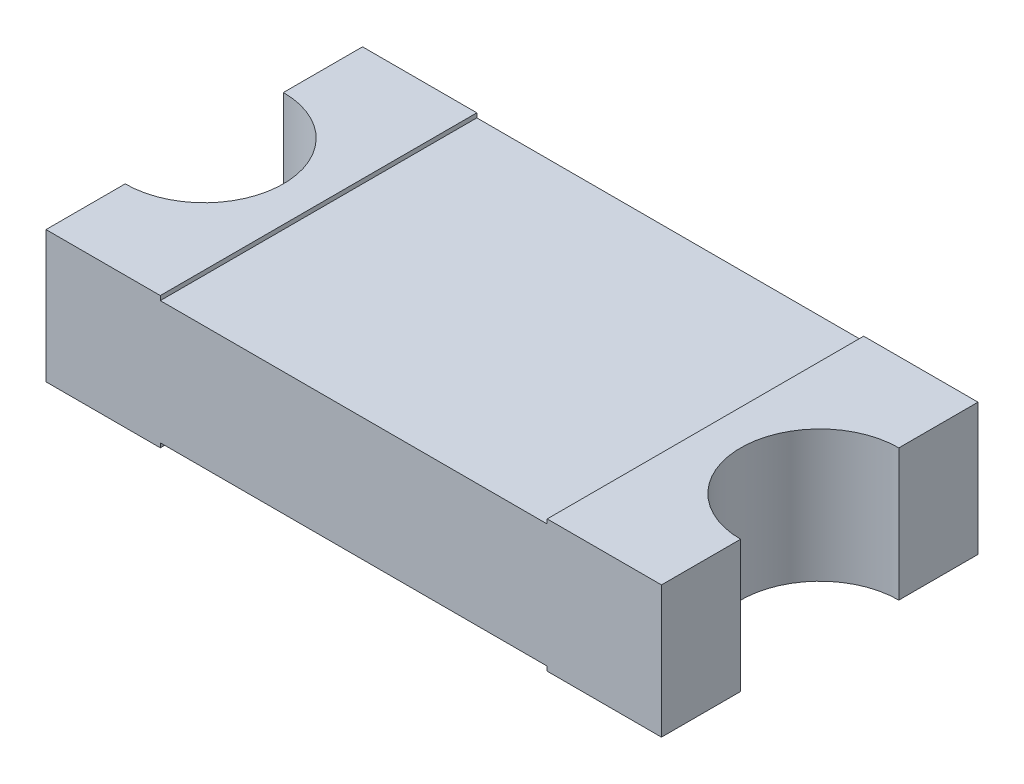
ISO-10303-21;
HEADER;
FILE_DESCRIPTION(('STEP AP214'),'2;1');
FILE_NAME('part.step','',(''),(''),'','','');
FILE_SCHEMA(('AUTOMOTIVE_DESIGN { 1 0 10303 214 1 1 1 1 }'));
ENDSEC;
DATA;
#1=APPLICATION_CONTEXT('core data for automotive mechanical design processes');
#2=APPLICATION_PROTOCOL_DEFINITION('international standard','automotive_design',2000,#1);
#3=PRODUCT_CONTEXT('',#1,'mechanical');
#4=PRODUCT('Part','Part','',(#3));
#5=PRODUCT_RELATED_PRODUCT_CATEGORY('part','',(#4));
#6=PRODUCT_DEFINITION_FORMATION('','',#4);
#7=PRODUCT_DEFINITION_CONTEXT('part definition',#1,'design');
#8=PRODUCT_DEFINITION('design','',#6,#7);
#9=PRODUCT_DEFINITION_SHAPE('','',#8);
#10=(LENGTH_UNIT() NAMED_UNIT(*) SI_UNIT(.MILLI.,.METRE.));
#11=(NAMED_UNIT(*) PLANE_ANGLE_UNIT() SI_UNIT($,.RADIAN.));
#12=(NAMED_UNIT(*) SI_UNIT($,.STERADIAN.) SOLID_ANGLE_UNIT());
#13=UNCERTAINTY_MEASURE_WITH_UNIT(LENGTH_MEASURE(1.E-05),#10,'distance_accuracy_value','');
#14=(GEOMETRIC_REPRESENTATION_CONTEXT(3) GLOBAL_UNCERTAINTY_ASSIGNED_CONTEXT((#13)) GLOBAL_UNIT_ASSIGNED_CONTEXT((#10,
#11,#12)) REPRESENTATION_CONTEXT('',''));
#15=CARTESIAN_POINT('',(0.,0.,0.));
#16=DIRECTION('',(0.,0.,1.));
#17=DIRECTION('',(1.,0.,0.));
#18=AXIS2_PLACEMENT_3D('',#15,#16,#17);
#19=CARTESIAN_POINT('',(-1.75,0.75,-0.9));
#20=DIRECTION('',(0.,0.,1.));
#21=DIRECTION('',(1.,0.,0.));
#22=AXIS2_PLACEMENT_3D('',#19,#20,#21);
#23=PLANE('',#22);
#24=DIRECTION('',(0.,-1.,0.));
#25=VECTOR('',#24,1.);
#26=CARTESIAN_POINT('',(1.1,0.025,-0.9));
#27=LINE('',#26,#25);
#28=CARTESIAN_POINT('',(1.1,0.025,-0.9));
#29=VERTEX_POINT('',#28);
#30=CARTESIAN_POINT('',(1.1,0.,-0.9));
#31=VERTEX_POINT('',#30);
#32=EDGE_CURVE('E174',#29,#31,#27,.T.);
#33=ORIENTED_EDGE('',*,*,#32,.F.);
#34=DIRECTION('',(-1.,0.,0.));
#35=VECTOR('',#34,1.);
#36=CARTESIAN_POINT('',(-1.1,0.025,-0.9));
#37=LINE('',#36,#35);
#38=CARTESIAN_POINT('',(-1.1,0.025,-0.9));
#39=VERTEX_POINT('',#38);
#40=EDGE_CURVE('E155',#29,#39,#37,.T.);
#41=ORIENTED_EDGE('',*,*,#40,.T.);
#42=DIRECTION('',(0.,-1.,0.));
#43=VECTOR('',#42,1.);
#44=CARTESIAN_POINT('',(-1.1,0.025,-0.9));
#45=LINE('',#44,#43);
#46=CARTESIAN_POINT('',(-1.1,0.,-0.9));
#47=VERTEX_POINT('',#46);
#48=EDGE_CURVE('E177',#39,#47,#45,.T.);
#49=ORIENTED_EDGE('',*,*,#48,.T.);
#50=DIRECTION('',(-1.,0.,0.));
#51=VECTOR('',#50,1.);
#52=CARTESIAN_POINT('',(-1.75,0.,-0.9));
#53=LINE('',#52,#51);
#54=CARTESIAN_POINT('',(-1.75,0.,-0.9));
#55=VERTEX_POINT('',#54);
#56=EDGE_CURVE('E199',#47,#55,#53,.T.);
#57=ORIENTED_EDGE('',*,*,#56,.T.);
#58=DIRECTION('',(0.,-1.,0.));
#59=VECTOR('',#58,1.);
#60=CARTESIAN_POINT('',(-1.75,0.75,-0.9));
#61=LINE('',#60,#59);
#62=CARTESIAN_POINT('',(-1.75,0.75,-0.9));
#63=VERTEX_POINT('',#62);
#64=EDGE_CURVE('E11',#63,#55,#61,.T.);
#65=ORIENTED_EDGE('',*,*,#64,.F.);
#66=DIRECTION('',(-1.,0.,0.));
#67=VECTOR('',#66,1.);
#68=CARTESIAN_POINT('',(-1.75,0.75,-0.9));
#69=LINE('',#68,#67);
#70=CARTESIAN_POINT('',(-1.1,0.75,-0.9));
#71=VERTEX_POINT('',#70);
#72=EDGE_CURVE('E210',#71,#63,#69,.T.);
#73=ORIENTED_EDGE('',*,*,#72,.F.);
#74=DIRECTION('',(0.,1.,0.));
#75=VECTOR('',#74,1.);
#76=CARTESIAN_POINT('',(-1.1,0.725,-0.9));
#77=LINE('',#76,#75);
#78=CARTESIAN_POINT('',(-1.1,0.725,-0.9));
#79=VERTEX_POINT('',#78);
#80=EDGE_CURVE('E55',#79,#71,#77,.T.);
#81=ORIENTED_EDGE('',*,*,#80,.F.);
#82=DIRECTION('',(-1.,0.,0.));
#83=VECTOR('',#82,1.);
#84=CARTESIAN_POINT('',(-1.1,0.725,-0.9));
#85=LINE('',#84,#83);
#86=CARTESIAN_POINT('',(1.1,0.725,-0.9));
#87=VERTEX_POINT('',#86);
#88=EDGE_CURVE('E184',#87,#79,#85,.T.);
#89=ORIENTED_EDGE('',*,*,#88,.F.);
#90=DIRECTION('',(0.,1.,0.));
#91=VECTOR('',#90,1.);
#92=CARTESIAN_POINT('',(1.1,0.725,-0.9));
#93=LINE('',#92,#91);
#94=CARTESIAN_POINT('',(1.1,0.75,-0.9));
#95=VERTEX_POINT('',#94);
#96=EDGE_CURVE('E194',#87,#95,#93,.T.);
#97=ORIENTED_EDGE('',*,*,#96,.T.);
#98=CARTESIAN_POINT('',(1.75,0.75,-0.9));
#99=VERTEX_POINT('',#98);
#100=EDGE_CURVE('E206',#99,#95,#69,.T.);
#101=ORIENTED_EDGE('',*,*,#100,.F.);
#102=DIRECTION('',(0.,-1.,0.));
#103=VECTOR('',#102,1.);
#104=CARTESIAN_POINT('',(1.75,0.75,-0.9));
#105=LINE('',#104,#103);
#106=CARTESIAN_POINT('',(1.75,0.,-0.9));
#107=VERTEX_POINT('',#106);
#108=EDGE_CURVE('E226',#99,#107,#105,.T.);
#109=ORIENTED_EDGE('',*,*,#108,.T.);
#110=EDGE_CURVE('E227',#107,#31,#53,.T.);
#111=ORIENTED_EDGE('',*,*,#110,.T.);
#112=EDGE_LOOP('',(#33,#41,#49,#57,#65,#73,#81,#89,#97,#101,#109,#111));
#113=FACE_BOUND('',#112,.T.);
#114=ADVANCED_FACE('F33',(#113),#23,.F.);
#115=CARTESIAN_POINT('',(-1.75,0.75,0.9));
#116=DIRECTION('',(0.,0.,-1.));
#117=DIRECTION('',(-1.,0.,0.));
#118=AXIS2_PLACEMENT_3D('',#115,#116,#117);
#119=PLANE('',#118);
#120=DIRECTION('',(0.,-1.,0.));
#121=VECTOR('',#120,1.);
#122=CARTESIAN_POINT('',(1.1,0.025,0.9));
#123=LINE('',#122,#121);
#124=CARTESIAN_POINT('',(1.1,0.025,0.9));
#125=VERTEX_POINT('',#124);
#126=CARTESIAN_POINT('',(1.1,0.,0.9));
#127=VERTEX_POINT('',#126);
#128=EDGE_CURVE('E145',#125,#127,#123,.T.);
#129=ORIENTED_EDGE('',*,*,#128,.T.);
#130=DIRECTION('',(1.,0.,0.));
#131=VECTOR('',#130,1.);
#132=CARTESIAN_POINT('',(-1.75,0.,0.9));
#133=LINE('',#132,#131);
#134=CARTESIAN_POINT('',(1.75,0.,0.9));
#135=VERTEX_POINT('',#134);
#136=EDGE_CURVE('E236',#127,#135,#133,.T.);
#137=ORIENTED_EDGE('',*,*,#136,.T.);
#138=DIRECTION('',(0.,-1.,0.));
#139=VECTOR('',#138,1.);
#140=CARTESIAN_POINT('',(1.75,0.75,0.9));
#141=LINE('',#140,#139);
#142=CARTESIAN_POINT('',(1.75,0.75,0.9));
#143=VERTEX_POINT('',#142);
#144=EDGE_CURVE('E253',#143,#135,#141,.T.);
#145=ORIENTED_EDGE('',*,*,#144,.F.);
#146=DIRECTION('',(1.,0.,0.));
#147=VECTOR('',#146,1.);
#148=CARTESIAN_POINT('',(-1.75,0.75,0.9));
#149=LINE('',#148,#147);
#150=CARTESIAN_POINT('',(1.1,0.75,0.9));
#151=VERTEX_POINT('',#150);
#152=EDGE_CURVE('E216',#151,#143,#149,.T.);
#153=ORIENTED_EDGE('',*,*,#152,.F.);
#154=DIRECTION('',(0.,1.,0.));
#155=VECTOR('',#154,1.);
#156=CARTESIAN_POINT('',(1.1,0.725,0.9));
#157=LINE('',#156,#155);
#158=CARTESIAN_POINT('',(1.1,0.725,0.9));
#159=VERTEX_POINT('',#158);
#160=EDGE_CURVE('E197',#159,#151,#157,.T.);
#161=ORIENTED_EDGE('',*,*,#160,.F.);
#162=DIRECTION('',(1.,0.,0.));
#163=VECTOR('',#162,1.);
#164=CARTESIAN_POINT('',(-1.1,0.725,0.9));
#165=LINE('',#164,#163);
#166=CARTESIAN_POINT('',(-1.1,0.725,0.9));
#167=VERTEX_POINT('',#166);
#168=EDGE_CURVE('E191',#167,#159,#165,.T.);
#169=ORIENTED_EDGE('',*,*,#168,.F.);
#170=DIRECTION('',(0.,1.,0.));
#171=VECTOR('',#170,1.);
#172=CARTESIAN_POINT('',(-1.1,0.725,0.9));
#173=LINE('',#172,#171);
#174=CARTESIAN_POINT('',(-1.1,0.75,0.9));
#175=VERTEX_POINT('',#174);
#176=EDGE_CURVE('E200',#167,#175,#173,.T.);
#177=ORIENTED_EDGE('',*,*,#176,.T.);
#178=CARTESIAN_POINT('',(-1.75,0.75,0.9));
#179=VERTEX_POINT('',#178);
#180=EDGE_CURVE('E217',#179,#175,#149,.T.);
#181=ORIENTED_EDGE('',*,*,#180,.F.);
#182=DIRECTION('',(0.,-1.,0.));
#183=VECTOR('',#182,1.);
#184=CARTESIAN_POINT('',(-1.75,0.75,0.9));
#185=LINE('',#184,#183);
#186=CARTESIAN_POINT('',(-1.75,0.,0.9));
#187=VERTEX_POINT('',#186);
#188=EDGE_CURVE('E256',#179,#187,#185,.T.);
#189=ORIENTED_EDGE('',*,*,#188,.T.);
#190=CARTESIAN_POINT('',(-1.1,0.,0.9));
#191=VERTEX_POINT('',#190);
#192=EDGE_CURVE('E237',#187,#191,#133,.T.);
#193=ORIENTED_EDGE('',*,*,#192,.T.);
#194=DIRECTION('',(0.,-1.,0.));
#195=VECTOR('',#194,1.);
#196=CARTESIAN_POINT('',(-1.1,0.025,0.9));
#197=LINE('',#196,#195);
#198=CARTESIAN_POINT('',(-1.1,0.025,0.9));
#199=VERTEX_POINT('',#198);
#200=EDGE_CURVE('E47',#199,#191,#197,.T.);
#201=ORIENTED_EDGE('',*,*,#200,.F.);
#202=DIRECTION('',(1.,0.,0.));
#203=VECTOR('',#202,1.);
#204=CARTESIAN_POINT('',(-1.1,0.025,0.9));
#205=LINE('',#204,#203);
#206=EDGE_CURVE('E161',#199,#125,#205,.T.);
#207=ORIENTED_EDGE('',*,*,#206,.T.);
#208=EDGE_LOOP('',(#129,#137,#145,#153,#161,#169,#177,#181,#189,#193,#201,#207));
#209=FACE_BOUND('',#208,.T.);
#210=ADVANCED_FACE('F165',(#209),#119,.F.);
#211=CARTESIAN_POINT('',(1.75,0.,0.));
#212=DIRECTION('',(0.,1.,0.));
#213=DIRECTION('',(0.,0.,1.));
#214=AXIS2_PLACEMENT_3D('',#211,#212,#213);
#215=PLANE('',#214);
#216=DIRECTION('',(0.,0.,-1.));
#217=VECTOR('',#216,1.);
#218=CARTESIAN_POINT('',(1.1,0.,-0.9));
#219=LINE('',#218,#217);
#220=EDGE_CURVE('E151',#127,#31,#219,.T.);
#221=ORIENTED_EDGE('',*,*,#220,.T.);
#222=ORIENTED_EDGE('',*,*,#110,.F.);
#223=DIRECTION('',(0.,0.,-1.));
#224=VECTOR('',#223,1.);
#225=CARTESIAN_POINT('',(1.75,0.,-0.45));
#226=LINE('',#225,#224);
#227=CARTESIAN_POINT('',(1.75,0.,-0.45));
#228=VERTEX_POINT('',#227);
#229=EDGE_CURVE('E243',#228,#107,#226,.T.);
#230=ORIENTED_EDGE('',*,*,#229,.F.);
#231=CARTESIAN_POINT('',(1.75,0.,0.));
#232=DIRECTION('',(0.,-1.,0.));
#233=DIRECTION('',(0.,0.,1.));
#234=AXIS2_PLACEMENT_3D('',#231,#232,#233);
#235=CIRCLE('',#234,0.45);
#236=CARTESIAN_POINT('',(1.75,0.,0.45));
#237=VERTEX_POINT('',#236);
#238=EDGE_CURVE('E241',#237,#228,#235,.T.);
#239=ORIENTED_EDGE('',*,*,#238,.F.);
#240=DIRECTION('',(0.,0.,-1.));
#241=VECTOR('',#240,1.);
#242=CARTESIAN_POINT('',(1.75,0.,0.9));
#243=LINE('',#242,#241);
#244=EDGE_CURVE('E239',#135,#237,#243,.T.);
#245=ORIENTED_EDGE('',*,*,#244,.F.);
#246=ORIENTED_EDGE('',*,*,#136,.F.);
#247=EDGE_LOOP('',(#221,#222,#230,#239,#245,#246));
#248=FACE_BOUND('',#247,.T.);
#249=ADVANCED_FACE('F291',(#248),#215,.F.);
#250=DIRECTION('',(0.,0.,1.));
#251=VECTOR('',#250,1.);
#252=CARTESIAN_POINT('',(-1.1,0.,-0.9));
#253=LINE('',#252,#251);
#254=EDGE_CURVE('E163',#47,#191,#253,.T.);
#255=ORIENTED_EDGE('',*,*,#254,.T.);
#256=ORIENTED_EDGE('',*,*,#192,.F.);
#257=DIRECTION('',(0.,0.,1.));
#258=VECTOR('',#257,1.);
#259=CARTESIAN_POINT('',(-1.75,0.,0.9));
#260=LINE('',#259,#258);
#261=CARTESIAN_POINT('',(-1.75,0.,0.45));
#262=VERTEX_POINT('',#261);
#263=EDGE_CURVE('E234',#262,#187,#260,.T.);
#264=ORIENTED_EDGE('',*,*,#263,.F.);
#265=CARTESIAN_POINT('',(-1.75,0.,0.));
#266=DIRECTION('',(0.,-1.,0.));
#267=DIRECTION('',(0.,0.,-1.));
#268=AXIS2_PLACEMENT_3D('',#265,#266,#267);
#269=CIRCLE('',#268,0.45);
#270=CARTESIAN_POINT('',(-1.75,0.,-0.45));
#271=VERTEX_POINT('',#270);
#272=EDGE_CURVE('E232',#271,#262,#269,.T.);
#273=ORIENTED_EDGE('',*,*,#272,.F.);
#274=DIRECTION('',(0.,0.,1.));
#275=VECTOR('',#274,1.);
#276=CARTESIAN_POINT('',(-1.75,0.,-0.45));
#277=LINE('',#276,#275);
#278=EDGE_CURVE('E230',#55,#271,#277,.T.);
#279=ORIENTED_EDGE('',*,*,#278,.F.);
#280=ORIENTED_EDGE('',*,*,#56,.F.);
#281=EDGE_LOOP('',(#255,#256,#264,#273,#279,#280));
#282=FACE_BOUND('',#281,.T.);
#283=ADVANCED_FACE('F273',(#282),#215,.F.);
#284=CARTESIAN_POINT('',(1.75,0.75,0.));
#285=DIRECTION('',(0.,1.,0.));
#286=DIRECTION('',(0.,0.,1.));
#287=AXIS2_PLACEMENT_3D('',#284,#285,#286);
#288=PLANE('',#287);
#289=DIRECTION('',(0.,0.,-1.));
#290=VECTOR('',#289,1.);
#291=CARTESIAN_POINT('',(1.1,0.75,-0.9));
#292=LINE('',#291,#290);
#293=EDGE_CURVE('E176',#151,#95,#292,.T.);
#294=ORIENTED_EDGE('',*,*,#293,.F.);
#295=ORIENTED_EDGE('',*,*,#152,.T.);
#296=DIRECTION('',(0.,0.,-1.));
#297=VECTOR('',#296,1.);
#298=CARTESIAN_POINT('',(1.75,0.75,0.9));
#299=LINE('',#298,#297);
#300=CARTESIAN_POINT('',(1.75,0.75,0.45));
#301=VERTEX_POINT('',#300);
#302=EDGE_CURVE('E220',#143,#301,#299,.T.);
#303=ORIENTED_EDGE('',*,*,#302,.T.);
#304=CARTESIAN_POINT('',(1.75,0.75,0.));
#305=DIRECTION('',(0.,-1.,0.));
#306=DIRECTION('',(0.,0.,1.));
#307=AXIS2_PLACEMENT_3D('',#304,#305,#306);
#308=CIRCLE('',#307,0.45);
#309=CARTESIAN_POINT('',(1.75,0.75,-0.45));
#310=VERTEX_POINT('',#309);
#311=EDGE_CURVE('E222',#301,#310,#308,.T.);
#312=ORIENTED_EDGE('',*,*,#311,.T.);
#313=DIRECTION('',(0.,0.,-1.));
#314=VECTOR('',#313,1.);
#315=CARTESIAN_POINT('',(1.75,0.75,-0.45));
#316=LINE('',#315,#314);
#317=EDGE_CURVE('E224',#310,#99,#316,.T.);
#318=ORIENTED_EDGE('',*,*,#317,.T.);
#319=ORIENTED_EDGE('',*,*,#100,.T.);
#320=EDGE_LOOP('',(#294,#295,#303,#312,#318,#319));
#321=FACE_BOUND('',#320,.T.);
#322=ADVANCED_FACE('F304',(#321),#288,.T.);
#323=CARTESIAN_POINT('',(-1.75,0.75,-0.45));
#324=DIRECTION('',(1.,0.,0.));
#325=DIRECTION('',(0.,0.,-1.));
#326=AXIS2_PLACEMENT_3D('',#323,#324,#325);
#327=PLANE('',#326);
#328=ORIENTED_EDGE('',*,*,#278,.T.);
#329=DIRECTION('',(0.,-1.,0.));
#330=VECTOR('',#329,1.);
#331=CARTESIAN_POINT('',(-1.75,0.75,-0.45));
#332=LINE('',#331,#330);
#333=CARTESIAN_POINT('',(-1.75,0.75,-0.45));
#334=VERTEX_POINT('',#333);
#335=EDGE_CURVE('E40',#334,#271,#332,.T.);
#336=ORIENTED_EDGE('',*,*,#335,.F.);
#337=DIRECTION('',(0.,0.,1.));
#338=VECTOR('',#337,1.);
#339=CARTESIAN_POINT('',(-1.75,0.75,-0.45));
#340=LINE('',#339,#338);
#341=EDGE_CURVE('E209',#63,#334,#340,.T.);
#342=ORIENTED_EDGE('',*,*,#341,.F.);
#343=ORIENTED_EDGE('',*,*,#64,.T.);
#344=EDGE_LOOP('',(#328,#336,#342,#343));
#345=FACE_BOUND('',#344,.T.);
#346=ADVANCED_FACE('F286',(#345),#327,.F.);
#347=CARTESIAN_POINT('',(-1.75,0.75,0.));
#348=DIRECTION('',(0.,-1.,0.));
#349=DIRECTION('',(0.,0.,-1.));
#350=AXIS2_PLACEMENT_3D('',#347,#348,#349);
#351=CYLINDRICAL_SURFACE('',#350,0.45);
#352=ORIENTED_EDGE('',*,*,#272,.T.);
#353=DIRECTION('',(0.,-1.,0.));
#354=VECTOR('',#353,1.);
#355=CARTESIAN_POINT('',(-1.75,0.75,0.45));
#356=LINE('',#355,#354);
#357=CARTESIAN_POINT('',(-1.75,0.75,0.45));
#358=VERTEX_POINT('',#357);
#359=EDGE_CURVE('E259',#358,#262,#356,.T.);
#360=ORIENTED_EDGE('',*,*,#359,.F.);
#361=CARTESIAN_POINT('',(-1.75,0.75,0.));
#362=DIRECTION('',(0.,-1.,0.));
#363=DIRECTION('',(0.,0.,-1.));
#364=AXIS2_PLACEMENT_3D('',#361,#362,#363);
#365=CIRCLE('',#364,0.45);
#366=EDGE_CURVE('E212',#334,#358,#365,.T.);
#367=ORIENTED_EDGE('',*,*,#366,.F.);
#368=ORIENTED_EDGE('',*,*,#335,.T.);
#369=EDGE_LOOP('',(#352,#360,#367,#368));
#370=FACE_BOUND('',#369,.T.);
#371=ADVANCED_FACE('F266',(#370),#351,.F.);
#372=CARTESIAN_POINT('',(-1.75,0.75,0.9));
#373=DIRECTION('',(1.,0.,0.));
#374=DIRECTION('',(0.,0.,-1.));
#375=AXIS2_PLACEMENT_3D('',#372,#373,#374);
#376=PLANE('',#375);
#377=ORIENTED_EDGE('',*,*,#263,.T.);
#378=ORIENTED_EDGE('',*,*,#188,.F.);
#379=DIRECTION('',(0.,0.,1.));
#380=VECTOR('',#379,1.);
#381=CARTESIAN_POINT('',(-1.75,0.75,0.9));
#382=LINE('',#381,#380);
#383=EDGE_CURVE('E214',#358,#179,#382,.T.);
#384=ORIENTED_EDGE('',*,*,#383,.F.);
#385=ORIENTED_EDGE('',*,*,#359,.T.);
#386=EDGE_LOOP('',(#377,#378,#384,#385));
#387=FACE_BOUND('',#386,.T.);
#388=ADVANCED_FACE('F278',(#387),#376,.F.);
#389=CARTESIAN_POINT('',(1.75,0.75,0.9));
#390=DIRECTION('',(-1.,0.,0.));
#391=DIRECTION('',(0.,0.,1.));
#392=AXIS2_PLACEMENT_3D('',#389,#390,#391);
#393=PLANE('',#392);
#394=ORIENTED_EDGE('',*,*,#244,.T.);
#395=DIRECTION('',(0.,-1.,0.));
#396=VECTOR('',#395,1.);
#397=CARTESIAN_POINT('',(1.75,0.75,0.45));
#398=LINE('',#397,#396);
#399=EDGE_CURVE('E250',#301,#237,#398,.T.);
#400=ORIENTED_EDGE('',*,*,#399,.F.);
#401=ORIENTED_EDGE('',*,*,#302,.F.);
#402=ORIENTED_EDGE('',*,*,#144,.T.);
#403=EDGE_LOOP('',(#394,#400,#401,#402));
#404=FACE_BOUND('',#403,.T.);
#405=ADVANCED_FACE('F299',(#404),#393,.F.);
#406=CARTESIAN_POINT('',(1.75,0.75,0.));
#407=DIRECTION('',(0.,-1.,0.));
#408=DIRECTION('',(0.,0.,-1.));
#409=AXIS2_PLACEMENT_3D('',#406,#407,#408);
#410=CYLINDRICAL_SURFACE('',#409,0.45);
#411=ORIENTED_EDGE('',*,*,#238,.T.);
#412=DIRECTION('',(0.,-1.,0.));
#413=VECTOR('',#412,1.);
#414=CARTESIAN_POINT('',(1.75,0.75,-0.45));
#415=LINE('',#414,#413);
#416=EDGE_CURVE('E247',#310,#228,#415,.T.);
#417=ORIENTED_EDGE('',*,*,#416,.F.);
#418=ORIENTED_EDGE('',*,*,#311,.F.);
#419=ORIENTED_EDGE('',*,*,#399,.T.);
#420=EDGE_LOOP('',(#411,#417,#418,#419));
#421=FACE_BOUND('',#420,.T.);
#422=ADVANCED_FACE('F349',(#421),#410,.F.);
#423=CARTESIAN_POINT('',(1.75,0.75,-0.45));
#424=DIRECTION('',(-1.,0.,0.));
#425=DIRECTION('',(0.,0.,1.));
#426=AXIS2_PLACEMENT_3D('',#423,#424,#425);
#427=PLANE('',#426);
#428=ORIENTED_EDGE('',*,*,#229,.T.);
#429=ORIENTED_EDGE('',*,*,#108,.F.);
#430=ORIENTED_EDGE('',*,*,#317,.F.);
#431=ORIENTED_EDGE('',*,*,#416,.T.);
#432=EDGE_LOOP('',(#428,#429,#430,#431));
#433=FACE_BOUND('',#432,.T.);
#434=ADVANCED_FACE('F345',(#433),#427,.F.);
#435=DIRECTION('',(0.,0.,1.));
#436=VECTOR('',#435,1.);
#437=CARTESIAN_POINT('',(-1.1,0.75,-0.9));
#438=LINE('',#437,#436);
#439=EDGE_CURVE('E185',#71,#175,#438,.T.);
#440=ORIENTED_EDGE('',*,*,#439,.F.);
#441=ORIENTED_EDGE('',*,*,#72,.T.);
#442=ORIENTED_EDGE('',*,*,#341,.T.);
#443=ORIENTED_EDGE('',*,*,#366,.T.);
#444=ORIENTED_EDGE('',*,*,#383,.T.);
#445=ORIENTED_EDGE('',*,*,#180,.T.);
#446=EDGE_LOOP('',(#440,#441,#442,#443,#444,#445));
#447=FACE_BOUND('',#446,.T.);
#448=ADVANCED_FACE('F283',(#447),#288,.T.);
#449=CARTESIAN_POINT('',(1.1,0.725,-0.9));
#450=DIRECTION('',(1.,0.,0.));
#451=DIRECTION('',(0.,0.,-1.));
#452=AXIS2_PLACEMENT_3D('',#449,#450,#451);
#453=PLANE('',#452);
#454=ORIENTED_EDGE('',*,*,#293,.T.);
#455=ORIENTED_EDGE('',*,*,#96,.F.);
#456=DIRECTION('',(0.,0.,-1.));
#457=VECTOR('',#456,1.);
#458=CARTESIAN_POINT('',(1.1,0.725,-0.9));
#459=LINE('',#458,#457);
#460=EDGE_CURVE('E181',#159,#87,#459,.T.);
#461=ORIENTED_EDGE('',*,*,#460,.F.);
#462=ORIENTED_EDGE('',*,*,#160,.T.);
#463=EDGE_LOOP('',(#454,#455,#461,#462));
#464=FACE_BOUND('',#463,.T.);
#465=ADVANCED_FACE('F308',(#464),#453,.F.);
#466=CARTESIAN_POINT('',(-1.1,0.725,-0.9));
#467=DIRECTION('',(-1.,0.,0.));
#468=DIRECTION('',(0.,0.,1.));
#469=AXIS2_PLACEMENT_3D('',#466,#467,#468);
#470=PLANE('',#469);
#471=ORIENTED_EDGE('',*,*,#439,.T.);
#472=ORIENTED_EDGE('',*,*,#176,.F.);
#473=DIRECTION('',(0.,0.,1.));
#474=VECTOR('',#473,1.);
#475=CARTESIAN_POINT('',(-1.1,0.725,-0.9));
#476=LINE('',#475,#474);
#477=EDGE_CURVE('E188',#79,#167,#476,.T.);
#478=ORIENTED_EDGE('',*,*,#477,.F.);
#479=ORIENTED_EDGE('',*,*,#80,.T.);
#480=EDGE_LOOP('',(#471,#472,#478,#479));
#481=FACE_BOUND('',#480,.T.);
#482=ADVANCED_FACE('F312',(#481),#470,.F.);
#483=CARTESIAN_POINT('',(0.,0.725,0.));
#484=DIRECTION('',(0.,1.,0.));
#485=DIRECTION('',(0.,0.,1.));
#486=AXIS2_PLACEMENT_3D('',#483,#484,#485);
#487=PLANE('',#486);
#488=ORIENTED_EDGE('',*,*,#460,.T.);
#489=ORIENTED_EDGE('',*,*,#88,.T.);
#490=ORIENTED_EDGE('',*,*,#477,.T.);
#491=ORIENTED_EDGE('',*,*,#168,.T.);
#492=EDGE_LOOP('',(#488,#489,#490,#491));
#493=FACE_BOUND('',#492,.T.);
#494=ADVANCED_FACE('F311',(#493),#487,.T.);
#495=CARTESIAN_POINT('',(1.1,0.025,-0.9));
#496=DIRECTION('',(-1.,0.,0.));
#497=DIRECTION('',(0.,0.,1.));
#498=AXIS2_PLACEMENT_3D('',#495,#496,#497);
#499=PLANE('',#498);
#500=ORIENTED_EDGE('',*,*,#220,.F.);
#501=ORIENTED_EDGE('',*,*,#128,.F.);
#502=DIRECTION('',(0.,0.,-1.));
#503=VECTOR('',#502,1.);
#504=CARTESIAN_POINT('',(1.1,0.025,-0.9));
#505=LINE('',#504,#503);
#506=EDGE_CURVE('E148',#125,#29,#505,.T.);
#507=ORIENTED_EDGE('',*,*,#506,.T.);
#508=ORIENTED_EDGE('',*,*,#32,.T.);
#509=EDGE_LOOP('',(#500,#501,#507,#508));
#510=FACE_BOUND('',#509,.T.);
#511=ADVANCED_FACE('F147',(#510),#499,.T.);
#512=CARTESIAN_POINT('',(-1.1,0.025,-0.9));
#513=DIRECTION('',(1.,0.,0.));
#514=DIRECTION('',(0.,0.,-1.));
#515=AXIS2_PLACEMENT_3D('',#512,#513,#514);
#516=PLANE('',#515);
#517=ORIENTED_EDGE('',*,*,#254,.F.);
#518=ORIENTED_EDGE('',*,*,#48,.F.);
#519=DIRECTION('',(0.,0.,1.));
#520=VECTOR('',#519,1.);
#521=CARTESIAN_POINT('',(-1.1,0.025,-0.9));
#522=LINE('',#521,#520);
#523=EDGE_CURVE('E167',#39,#199,#522,.T.);
#524=ORIENTED_EDGE('',*,*,#523,.T.);
#525=ORIENTED_EDGE('',*,*,#200,.T.);
#526=EDGE_LOOP('',(#517,#518,#524,#525));
#527=FACE_BOUND('',#526,.T.);
#528=ADVANCED_FACE('F288',(#527),#516,.T.);
#529=CARTESIAN_POINT('',(0.,0.025,0.));
#530=DIRECTION('',(0.,-1.,0.));
#531=DIRECTION('',(0.,0.,1.));
#532=AXIS2_PLACEMENT_3D('',#529,#530,#531);
#533=PLANE('',#532);
#534=ORIENTED_EDGE('',*,*,#506,.F.);
#535=ORIENTED_EDGE('',*,*,#206,.F.);
#536=ORIENTED_EDGE('',*,*,#523,.F.);
#537=ORIENTED_EDGE('',*,*,#40,.F.);
#538=EDGE_LOOP('',(#534,#535,#536,#537));
#539=FACE_BOUND('',#538,.T.);
#540=ADVANCED_FACE('F159',(#539),#533,.T.);
#541=CLOSED_SHELL('',(#114,#210,#249,#283,#322,#346,#371,#388,#405,#422,#434,#448,#465,#482,
#494,#511,#528,#540));
#542=MANIFOLD_SOLID_BREP('B2',#541);
#543=ADVANCED_BREP_SHAPE_REPRESENTATION('',(#18,#542),#14);
#544=SHAPE_DEFINITION_REPRESENTATION(#9,#543);
ENDSEC;
END-ISO-10303-21;
